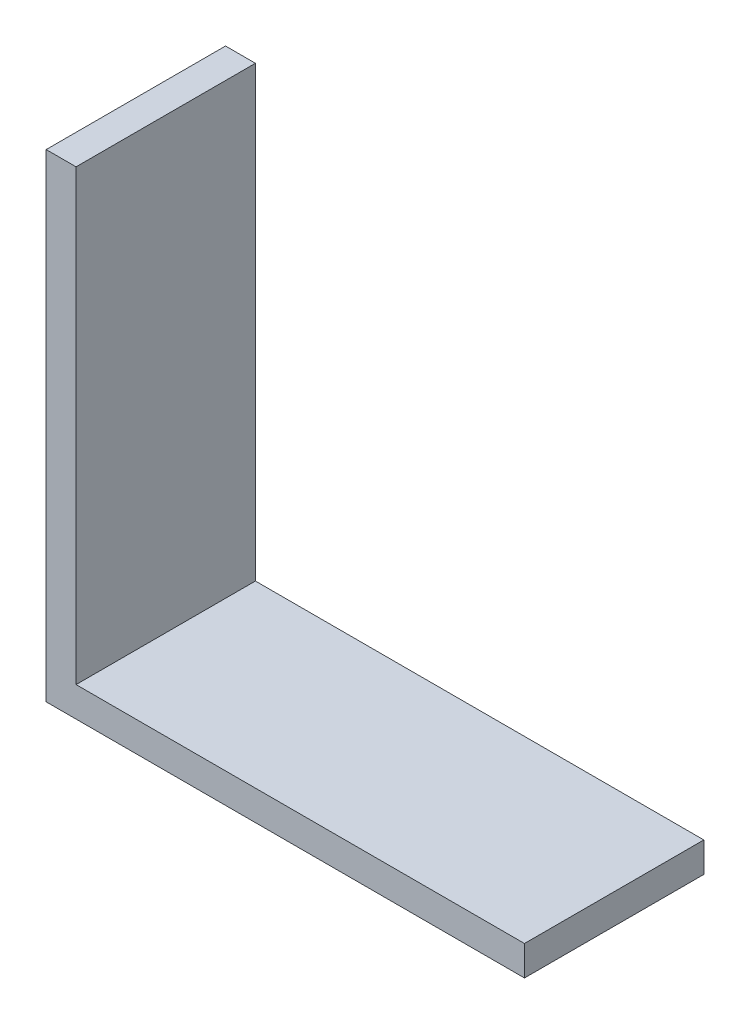
ISO-10303-21;
HEADER;
FILE_DESCRIPTION(('STEP AP214'),'2;1');
FILE_NAME('part.step','',(''),(''),'','','');
FILE_SCHEMA(('AUTOMOTIVE_DESIGN { 1 0 10303 214 1 1 1 1 }'));
ENDSEC;
DATA;
#1=APPLICATION_CONTEXT('core data for automotive mechanical design processes');
#2=APPLICATION_PROTOCOL_DEFINITION('international standard','automotive_design',2000,#1);
#3=PRODUCT_CONTEXT('',#1,'mechanical');
#4=PRODUCT('Part','Part','',(#3));
#5=PRODUCT_RELATED_PRODUCT_CATEGORY('part','',(#4));
#6=PRODUCT_DEFINITION_FORMATION('','',#4);
#7=PRODUCT_DEFINITION_CONTEXT('part definition',#1,'design');
#8=PRODUCT_DEFINITION('design','',#6,#7);
#9=PRODUCT_DEFINITION_SHAPE('','',#8);
#10=(LENGTH_UNIT() NAMED_UNIT(*) SI_UNIT(.MILLI.,.METRE.));
#11=(NAMED_UNIT(*) PLANE_ANGLE_UNIT() SI_UNIT($,.RADIAN.));
#12=(NAMED_UNIT(*) SI_UNIT($,.STERADIAN.) SOLID_ANGLE_UNIT());
#13=UNCERTAINTY_MEASURE_WITH_UNIT(LENGTH_MEASURE(1.E-05),#10,'distance_accuracy_value','');
#14=(GEOMETRIC_REPRESENTATION_CONTEXT(3) GLOBAL_UNCERTAINTY_ASSIGNED_CONTEXT((#13)) GLOBAL_UNIT_ASSIGNED_CONTEXT((#10,
#11,#12)) REPRESENTATION_CONTEXT('',''));
#15=CARTESIAN_POINT('',(0.,0.,0.));
#16=DIRECTION('',(0.,0.,1.));
#17=DIRECTION('',(1.,0.,0.));
#18=AXIS2_PLACEMENT_3D('',#15,#16,#17);
#19=CARTESIAN_POINT('',(50.8,0.,9.525));
#20=DIRECTION('',(0.,1.,0.));
#21=DIRECTION('',(-1.,0.,0.));
#22=AXIS2_PLACEMENT_3D('',#19,#20,#21);
#23=PLANE('',#22);
#24=DIRECTION('',(1.,0.,0.));
#25=VECTOR('',#24,1.);
#26=CARTESIAN_POINT('',(50.8,0.,-9.525));
#27=LINE('',#26,#25);
#28=CARTESIAN_POINT('',(0.,0.,-9.525));
#29=VERTEX_POINT('',#28);
#30=CARTESIAN_POINT('',(50.8,0.,-9.525));
#31=VERTEX_POINT('',#30);
#32=EDGE_CURVE('E118',#29,#31,#27,.T.);
#33=ORIENTED_EDGE('',*,*,#32,.T.);
#34=DIRECTION('',(0.,0.,-1.));
#35=VECTOR('',#34,1.);
#36=CARTESIAN_POINT('',(50.8,0.,9.525));
#37=LINE('',#36,#35);
#38=CARTESIAN_POINT('',(50.8,0.,9.525));
#39=VERTEX_POINT('',#38);
#40=EDGE_CURVE('E11',#39,#31,#37,.T.);
#41=ORIENTED_EDGE('',*,*,#40,.F.);
#42=DIRECTION('',(1.,0.,0.));
#43=VECTOR('',#42,1.);
#44=CARTESIAN_POINT('',(50.8,0.,9.525));
#45=LINE('',#44,#43);
#46=CARTESIAN_POINT('',(0.,0.,9.525));
#47=VERTEX_POINT('',#46);
#48=EDGE_CURVE('E128',#47,#39,#45,.T.);
#49=ORIENTED_EDGE('',*,*,#48,.F.);
#50=DIRECTION('',(0.,0.,-1.));
#51=VECTOR('',#50,1.);
#52=CARTESIAN_POINT('',(0.,0.,9.525));
#53=LINE('',#52,#51);
#54=EDGE_CURVE('E114',#47,#29,#53,.T.);
#55=ORIENTED_EDGE('',*,*,#54,.T.);
#56=EDGE_LOOP('',(#33,#41,#49,#55));
#57=FACE_BOUND('',#56,.T.);
#58=ADVANCED_FACE('F34',(#57),#23,.F.);
#59=CARTESIAN_POINT('',(50.8,3.175,9.525));
#60=DIRECTION('',(-1.,0.,0.));
#61=DIRECTION('',(0.,0.,1.));
#62=AXIS2_PLACEMENT_3D('',#59,#60,#61);
#63=PLANE('',#62);
#64=DIRECTION('',(0.,1.,0.));
#65=VECTOR('',#64,1.);
#66=CARTESIAN_POINT('',(50.8,3.175,-9.525));
#67=LINE('',#66,#65);
#68=CARTESIAN_POINT('',(50.8,3.175,-9.525));
#69=VERTEX_POINT('',#68);
#70=EDGE_CURVE('E121',#31,#69,#67,.T.);
#71=ORIENTED_EDGE('',*,*,#70,.T.);
#72=DIRECTION('',(0.,0.,-1.));
#73=VECTOR('',#72,1.);
#74=CARTESIAN_POINT('',(50.8,3.175,9.525));
#75=LINE('',#74,#73);
#76=CARTESIAN_POINT('',(50.8,3.175,9.525));
#77=VERTEX_POINT('',#76);
#78=EDGE_CURVE('E42',#77,#69,#75,.T.);
#79=ORIENTED_EDGE('',*,*,#78,.F.);
#80=DIRECTION('',(0.,1.,0.));
#81=VECTOR('',#80,1.);
#82=CARTESIAN_POINT('',(50.8,3.175,9.525));
#83=LINE('',#82,#81);
#84=EDGE_CURVE('E87',#39,#77,#83,.T.);
#85=ORIENTED_EDGE('',*,*,#84,.F.);
#86=ORIENTED_EDGE('',*,*,#40,.T.);
#87=EDGE_LOOP('',(#71,#79,#85,#86));
#88=FACE_BOUND('',#87,.T.);
#89=ADVANCED_FACE('F152',(#88),#63,.F.);
#90=CARTESIAN_POINT('',(3.175,3.175,9.525));
#91=DIRECTION('',(0.,-1.,0.));
#92=DIRECTION('',(0.,0.,-1.));
#93=AXIS2_PLACEMENT_3D('',#90,#91,#92);
#94=PLANE('',#93);
#95=DIRECTION('',(-1.,0.,0.));
#96=VECTOR('',#95,1.);
#97=CARTESIAN_POINT('',(3.175,3.175,-9.525));
#98=LINE('',#97,#96);
#99=CARTESIAN_POINT('',(3.175,3.175,-9.525));
#100=VERTEX_POINT('',#99);
#101=EDGE_CURVE('E123',#69,#100,#98,.T.);
#102=ORIENTED_EDGE('',*,*,#101,.T.);
#103=DIRECTION('',(0.,0.,-1.));
#104=VECTOR('',#103,1.);
#105=CARTESIAN_POINT('',(3.175,3.175,9.525));
#106=LINE('',#105,#104);
#107=CARTESIAN_POINT('',(3.175,3.175,9.525));
#108=VERTEX_POINT('',#107);
#109=EDGE_CURVE('E109',#108,#100,#106,.T.);
#110=ORIENTED_EDGE('',*,*,#109,.F.);
#111=DIRECTION('',(-1.,0.,0.));
#112=VECTOR('',#111,1.);
#113=CARTESIAN_POINT('',(3.175,3.175,9.525));
#114=LINE('',#113,#112);
#115=EDGE_CURVE('E100',#77,#108,#114,.T.);
#116=ORIENTED_EDGE('',*,*,#115,.F.);
#117=ORIENTED_EDGE('',*,*,#78,.T.);
#118=EDGE_LOOP('',(#102,#110,#116,#117));
#119=FACE_BOUND('',#118,.T.);
#120=ADVANCED_FACE('F134',(#119),#94,.F.);
#121=CARTESIAN_POINT('',(3.175,50.8,9.525));
#122=DIRECTION('',(-1.,0.,0.));
#123=DIRECTION('',(0.,-1.,0.));
#124=AXIS2_PLACEMENT_3D('',#121,#122,#123);
#125=PLANE('',#124);
#126=DIRECTION('',(0.,1.,0.));
#127=VECTOR('',#126,1.);
#128=CARTESIAN_POINT('',(3.175,50.8,-9.525));
#129=LINE('',#128,#127);
#130=CARTESIAN_POINT('',(3.175,50.8,-9.525));
#131=VERTEX_POINT('',#130);
#132=EDGE_CURVE('E108',#100,#131,#129,.T.);
#133=ORIENTED_EDGE('',*,*,#132,.T.);
#134=DIRECTION('',(0.,0.,-1.));
#135=VECTOR('',#134,1.);
#136=CARTESIAN_POINT('',(3.175,50.8,9.525));
#137=LINE('',#136,#135);
#138=CARTESIAN_POINT('',(3.175,50.8,9.525));
#139=VERTEX_POINT('',#138);
#140=EDGE_CURVE('E105',#139,#131,#137,.T.);
#141=ORIENTED_EDGE('',*,*,#140,.F.);
#142=DIRECTION('',(0.,1.,0.));
#143=VECTOR('',#142,1.);
#144=CARTESIAN_POINT('',(3.175,50.8,9.525));
#145=LINE('',#144,#143);
#146=EDGE_CURVE('E94',#108,#139,#145,.T.);
#147=ORIENTED_EDGE('',*,*,#146,.F.);
#148=ORIENTED_EDGE('',*,*,#109,.T.);
#149=EDGE_LOOP('',(#133,#141,#147,#148));
#150=FACE_BOUND('',#149,.T.);
#151=ADVANCED_FACE('F106',(#150),#125,.F.);
#152=CARTESIAN_POINT('',(0.,50.8,9.525));
#153=DIRECTION('',(0.,-1.,0.));
#154=DIRECTION('',(0.,0.,-1.));
#155=AXIS2_PLACEMENT_3D('',#152,#153,#154);
#156=PLANE('',#155);
#157=DIRECTION('',(-1.,0.,0.));
#158=VECTOR('',#157,1.);
#159=CARTESIAN_POINT('',(0.,50.8,-9.525));
#160=LINE('',#159,#158);
#161=CARTESIAN_POINT('',(0.,50.8,-9.525));
#162=VERTEX_POINT('',#161);
#163=EDGE_CURVE('E73',#131,#162,#160,.T.);
#164=ORIENTED_EDGE('',*,*,#163,.T.);
#165=DIRECTION('',(0.,0.,-1.));
#166=VECTOR('',#165,1.);
#167=CARTESIAN_POINT('',(0.,50.8,9.525));
#168=LINE('',#167,#166);
#169=CARTESIAN_POINT('',(0.,50.8,9.525));
#170=VERTEX_POINT('',#169);
#171=EDGE_CURVE('E110',#170,#162,#168,.T.);
#172=ORIENTED_EDGE('',*,*,#171,.F.);
#173=DIRECTION('',(-1.,0.,0.));
#174=VECTOR('',#173,1.);
#175=CARTESIAN_POINT('',(0.,50.8,9.525));
#176=LINE('',#175,#174);
#177=EDGE_CURVE('E98',#139,#170,#176,.T.);
#178=ORIENTED_EDGE('',*,*,#177,.F.);
#179=ORIENTED_EDGE('',*,*,#140,.T.);
#180=EDGE_LOOP('',(#164,#172,#178,#179));
#181=FACE_BOUND('',#180,.T.);
#182=ADVANCED_FACE('F112',(#181),#156,.F.);
#183=CARTESIAN_POINT('',(0.,0.,9.525));
#184=DIRECTION('',(1.,0.,0.));
#185=DIRECTION('',(0.,0.,-1.));
#186=AXIS2_PLACEMENT_3D('',#183,#184,#185);
#187=PLANE('',#186);
#188=DIRECTION('',(0.,-1.,0.));
#189=VECTOR('',#188,1.);
#190=CARTESIAN_POINT('',(0.,0.,-9.525));
#191=LINE('',#190,#189);
#192=EDGE_CURVE('E79',#162,#29,#191,.T.);
#193=ORIENTED_EDGE('',*,*,#192,.T.);
#194=ORIENTED_EDGE('',*,*,#54,.F.);
#195=DIRECTION('',(0.,-1.,0.));
#196=VECTOR('',#195,1.);
#197=CARTESIAN_POINT('',(0.,0.,9.525));
#198=LINE('',#197,#196);
#199=EDGE_CURVE('E50',#170,#47,#198,.T.);
#200=ORIENTED_EDGE('',*,*,#199,.F.);
#201=ORIENTED_EDGE('',*,*,#171,.T.);
#202=EDGE_LOOP('',(#193,#194,#200,#201));
#203=FACE_BOUND('',#202,.T.);
#204=ADVANCED_FACE('F141',(#203),#187,.F.);
#205=CARTESIAN_POINT('',(0.,0.,9.525));
#206=DIRECTION('',(0.,0.,-1.));
#207=DIRECTION('',(-1.,0.,0.));
#208=AXIS2_PLACEMENT_3D('',#205,#206,#207);
#209=PLANE('',#208);
#210=ORIENTED_EDGE('',*,*,#48,.T.);
#211=ORIENTED_EDGE('',*,*,#84,.T.);
#212=ORIENTED_EDGE('',*,*,#115,.T.);
#213=ORIENTED_EDGE('',*,*,#146,.T.);
#214=ORIENTED_EDGE('',*,*,#177,.T.);
#215=ORIENTED_EDGE('',*,*,#199,.T.);
#216=EDGE_LOOP('',(#210,#211,#212,#213,#214,#215));
#217=FACE_BOUND('',#216,.T.);
#218=ADVANCED_FACE('F96',(#217),#209,.F.);
#219=CARTESIAN_POINT('',(0.,0.,-9.525));
#220=DIRECTION('',(0.,0.,-1.));
#221=DIRECTION('',(-1.,0.,0.));
#222=AXIS2_PLACEMENT_3D('',#219,#220,#221);
#223=PLANE('',#222);
#224=ORIENTED_EDGE('',*,*,#32,.F.);
#225=ORIENTED_EDGE('',*,*,#192,.F.);
#226=ORIENTED_EDGE('',*,*,#163,.F.);
#227=ORIENTED_EDGE('',*,*,#132,.F.);
#228=ORIENTED_EDGE('',*,*,#101,.F.);
#229=ORIENTED_EDGE('',*,*,#70,.F.);
#230=EDGE_LOOP('',(#224,#225,#226,#227,#228,#229));
#231=FACE_BOUND('',#230,.T.);
#232=ADVANCED_FACE('F137',(#231),#223,.T.);
#233=CLOSED_SHELL('',(#58,#89,#120,#151,#182,#204,#218,#232));
#234=MANIFOLD_SOLID_BREP('B2',#233);
#235=ADVANCED_BREP_SHAPE_REPRESENTATION('',(#18,#234),#14);
#236=SHAPE_DEFINITION_REPRESENTATION(#9,#235);
ENDSEC;
END-ISO-10303-21;
